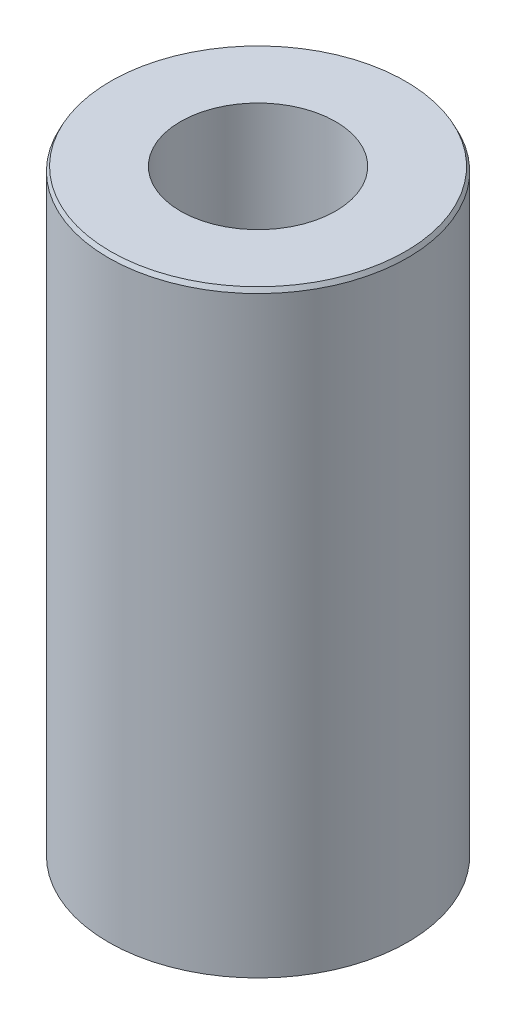
ISO-10303-21;
HEADER;
FILE_DESCRIPTION(('STEP AP214'),'2;1');
FILE_NAME('part.step','',(''),(''),'','','');
FILE_SCHEMA(('AUTOMOTIVE_DESIGN { 1 0 10303 214 1 1 1 1 }'));
ENDSEC;
DATA;
#1=APPLICATION_CONTEXT('core data for automotive mechanical design processes');
#2=APPLICATION_PROTOCOL_DEFINITION('international standard','automotive_design',2000,#1);
#3=PRODUCT_CONTEXT('',#1,'mechanical');
#4=PRODUCT('Part','Part','',(#3));
#5=PRODUCT_RELATED_PRODUCT_CATEGORY('part','',(#4));
#6=PRODUCT_DEFINITION_FORMATION('','',#4);
#7=PRODUCT_DEFINITION_CONTEXT('part definition',#1,'design');
#8=PRODUCT_DEFINITION('design','',#6,#7);
#9=PRODUCT_DEFINITION_SHAPE('','',#8);
#10=(LENGTH_UNIT() NAMED_UNIT(*) SI_UNIT(.MILLI.,.METRE.));
#11=(NAMED_UNIT(*) PLANE_ANGLE_UNIT() SI_UNIT($,.RADIAN.));
#12=(NAMED_UNIT(*) SI_UNIT($,.STERADIAN.) SOLID_ANGLE_UNIT());
#13=UNCERTAINTY_MEASURE_WITH_UNIT(LENGTH_MEASURE(1.E-05),#10,'distance_accuracy_value','');
#14=(GEOMETRIC_REPRESENTATION_CONTEXT(3) GLOBAL_UNCERTAINTY_ASSIGNED_CONTEXT((#13)) GLOBAL_UNIT_ASSIGNED_CONTEXT((#10,
#11,#12)) REPRESENTATION_CONTEXT('',''));
#15=CARTESIAN_POINT('',(0.,0.,0.));
#16=DIRECTION('',(0.,0.,1.));
#17=DIRECTION('',(1.,0.,0.));
#18=AXIS2_PLACEMENT_3D('',#15,#16,#17);
#19=CARTESIAN_POINT('',(0.,70.0691235850349,0.));
#20=DIRECTION('',(0.,-1.,0.));
#21=DIRECTION('',(0.,0.,-1.));
#22=AXIS2_PLACEMENT_3D('',#19,#20,#21);
#23=CYLINDRICAL_SURFACE('',#22,17.5);
#24=CARTESIAN_POINT('',(0.,69.5579738717585,0.));
#25=DIRECTION('',(0.,1.,0.));
#26=DIRECTION('',(0.,0.,1.));
#27=AXIS2_PLACEMENT_3D('',#24,#25,#26);
#28=CIRCLE('',#27,17.5);
#29=CARTESIAN_POINT('',(0.,69.5579738717585,17.5));
#30=VERTEX_POINT('',#29);
#31=EDGE_CURVE('E50',#30,#30,#28,.F.);
#32=ORIENTED_EDGE('',*,*,#31,.T.);
#33=EDGE_LOOP('',(#32));
#34=FACE_BOUND('',#33,.T.);
#35=CARTESIAN_POINT('',(0.,0.258746377227892,0.));
#36=DIRECTION('',(0.,1.,0.));
#37=DIRECTION('',(0.,0.,1.));
#38=AXIS2_PLACEMENT_3D('',#35,#36,#37);
#39=CIRCLE('',#38,17.5);
#40=CARTESIAN_POINT('',(0.,0.258746377227892,17.5));
#41=VERTEX_POINT('',#40);
#42=EDGE_CURVE('E51',#41,#41,#39,.T.);
#43=ORIENTED_EDGE('',*,*,#42,.T.);
#44=EDGE_LOOP('',(#43));
#45=FACE_BOUND('',#44,.T.);
#46=ADVANCED_FACE('F39',(#34,#45),#23,.T.);
#47=CARTESIAN_POINT('',(0.,70.0691235850349,0.));
#48=DIRECTION('',(0.,1.,0.));
#49=DIRECTION('',(0.,0.,1.));
#50=AXIS2_PLACEMENT_3D('',#47,#48,#49);
#51=PLANE('',#50);
#52=CARTESIAN_POINT('',(0.,70.0691235850349,0.));
#53=DIRECTION('',(0.,1.,0.));
#54=DIRECTION('',(0.,0.,1.));
#55=AXIS2_PLACEMENT_3D('',#52,#53,#54);
#56=CIRCLE('',#55,17.2412536227721);
#57=CARTESIAN_POINT('',(0.,70.0691235850349,17.2412536227721));
#58=VERTEX_POINT('',#57);
#59=EDGE_CURVE('E54',#58,#58,#56,.T.);
#60=ORIENTED_EDGE('',*,*,#59,.T.);
#61=EDGE_LOOP('',(#60));
#62=FACE_BOUND('',#61,.T.);
#63=CARTESIAN_POINT('',(0.,70.0691235850349,0.));
#64=DIRECTION('',(0.,1.,0.));
#65=DIRECTION('',(0.,0.,1.));
#66=AXIS2_PLACEMENT_3D('',#63,#64,#65);
#67=CIRCLE('',#66,9.0718152033829);
#68=CARTESIAN_POINT('',(0.,70.0691235850349,9.0718152033829));
#69=VERTEX_POINT('',#68);
#70=EDGE_CURVE('E58',#69,#69,#67,.T.);
#71=ORIENTED_EDGE('',*,*,#70,.F.);
#72=EDGE_LOOP('',(#71));
#73=FACE_BOUND('',#72,.T.);
#74=ADVANCED_FACE('F69',(#62,#73),#51,.T.);
#75=CARTESIAN_POINT('',(0.,0.,0.));
#76=DIRECTION('',(0.,1.,0.));
#77=DIRECTION('',(0.,0.,1.));
#78=AXIS2_PLACEMENT_3D('',#75,#76,#77);
#79=PLANE('',#78);
#80=CARTESIAN_POINT('',(0.,0.,0.));
#81=DIRECTION('',(0.,1.,0.));
#82=DIRECTION('',(0.,0.,1.));
#83=AXIS2_PLACEMENT_3D('',#80,#81,#82);
#84=CIRCLE('',#83,16.9888502867236);
#85=CARTESIAN_POINT('',(0.,0.,16.9888502867236));
#86=VERTEX_POINT('',#85);
#87=EDGE_CURVE('E10',#86,#86,#84,.F.);
#88=ORIENTED_EDGE('',*,*,#87,.T.);
#89=EDGE_LOOP('',(#88));
#90=FACE_BOUND('',#89,.T.);
#91=CARTESIAN_POINT('',(0.,0.,0.));
#92=DIRECTION('',(0.,1.,0.));
#93=DIRECTION('',(0.,0.,1.));
#94=AXIS2_PLACEMENT_3D('',#91,#92,#93);
#95=CIRCLE('',#94,9.0718152033829);
#96=CARTESIAN_POINT('',(0.,0.,9.0718152033829));
#97=VERTEX_POINT('',#96);
#98=EDGE_CURVE('E63',#97,#97,#95,.T.);
#99=ORIENTED_EDGE('',*,*,#98,.T.);
#100=EDGE_LOOP('',(#99));
#101=FACE_BOUND('',#100,.T.);
#102=ADVANCED_FACE('F75',(#90,#101),#79,.F.);
#103=CARTESIAN_POINT('',(0.,70.0691235850349,0.));
#104=DIRECTION('',(0.,-1.,0.));
#105=DIRECTION('',(0.,0.,-1.));
#106=AXIS2_PLACEMENT_3D('',#103,#104,#105);
#107=CYLINDRICAL_SURFACE('',#106,9.0718152033829);
#108=ORIENTED_EDGE('',*,*,#70,.T.);
#109=EDGE_LOOP('',(#108));
#110=FACE_BOUND('',#109,.T.);
#111=ORIENTED_EDGE('',*,*,#98,.F.);
#112=EDGE_LOOP('',(#111));
#113=FACE_BOUND('',#112,.T.);
#114=ADVANCED_FACE('F70',(#110,#113),#107,.F.);
#115=CARTESIAN_POINT('',(0.,70.0691235850349,0.));
#116=DIRECTION('',(0.,-1.,0.));
#117=DIRECTION('',(0.,0.,-1.));
#118=AXIS2_PLACEMENT_3D('',#115,#116,#117);
#119=CONICAL_SURFACE('',#118,17.2412536227721,0.468599023949542);
#120=ORIENTED_EDGE('',*,*,#31,.F.);
#121=EDGE_LOOP('',(#120));
#122=FACE_BOUND('',#121,.T.);
#123=ORIENTED_EDGE('',*,*,#59,.F.);
#124=EDGE_LOOP('',(#123));
#125=FACE_BOUND('',#124,.T.);
#126=ADVANCED_FACE('F81',(#122,#125),#119,.T.);
#127=CARTESIAN_POINT('',(0.,0.258746377227892,0.));
#128=DIRECTION('',(0.,1.,0.));
#129=DIRECTION('',(0.,0.,1.));
#130=AXIS2_PLACEMENT_3D('',#127,#128,#129);
#131=CONICAL_SURFACE('',#130,17.5,1.10219730284536);
#132=ORIENTED_EDGE('',*,*,#87,.F.);
#133=EDGE_LOOP('',(#132));
#134=FACE_BOUND('',#133,.T.);
#135=ORIENTED_EDGE('',*,*,#42,.F.);
#136=EDGE_LOOP('',(#135));
#137=FACE_BOUND('',#136,.T.);
#138=ADVANCED_FACE('F45',(#134,#137),#131,.T.);
#139=CLOSED_SHELL('',(#46,#74,#102,#114,#126,#138));
#140=MANIFOLD_SOLID_BREP('B2',#139);
#141=ADVANCED_BREP_SHAPE_REPRESENTATION('',(#18,#140),#14);
#142=SHAPE_DEFINITION_REPRESENTATION(#9,#141);
ENDSEC;
END-ISO-10303-21;
